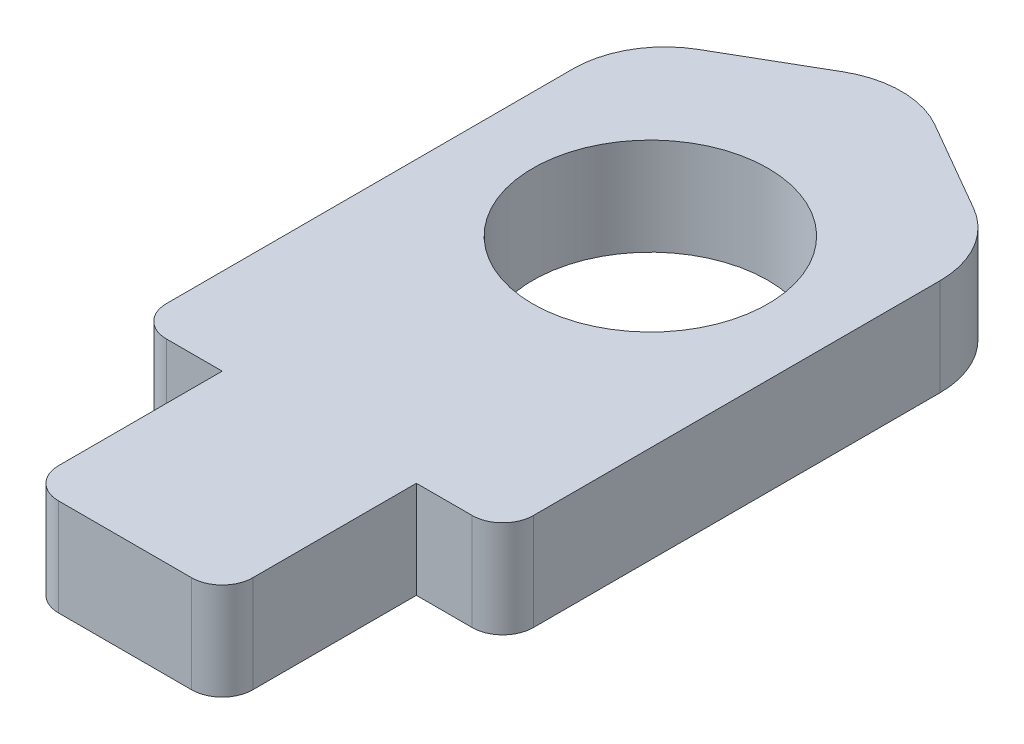
ISO-10303-21;
HEADER;
FILE_DESCRIPTION(('STEP AP214'),'2;1');
FILE_NAME('part.step','',(''),(''),'','','');
FILE_SCHEMA(('AUTOMOTIVE_DESIGN { 1 0 10303 214 1 1 1 1 }'));
ENDSEC;
DATA;
#1=APPLICATION_CONTEXT('core data for automotive mechanical design processes');
#2=APPLICATION_PROTOCOL_DEFINITION('international standard','automotive_design',2000,#1);
#3=PRODUCT_CONTEXT('',#1,'mechanical');
#4=PRODUCT('Part','Part','',(#3));
#5=PRODUCT_RELATED_PRODUCT_CATEGORY('part','',(#4));
#6=PRODUCT_DEFINITION_FORMATION('','',#4);
#7=PRODUCT_DEFINITION_CONTEXT('part definition',#1,'design');
#8=PRODUCT_DEFINITION('design','',#6,#7);
#9=PRODUCT_DEFINITION_SHAPE('','',#8);
#10=(LENGTH_UNIT() NAMED_UNIT(*) SI_UNIT(.MILLI.,.METRE.));
#11=(NAMED_UNIT(*) PLANE_ANGLE_UNIT() SI_UNIT($,.RADIAN.));
#12=(NAMED_UNIT(*) SI_UNIT($,.STERADIAN.) SOLID_ANGLE_UNIT());
#13=UNCERTAINTY_MEASURE_WITH_UNIT(LENGTH_MEASURE(1.E-05),#10,'distance_accuracy_value','');
#14=(GEOMETRIC_REPRESENTATION_CONTEXT(3) GLOBAL_UNCERTAINTY_ASSIGNED_CONTEXT((#13)) GLOBAL_UNIT_ASSIGNED_CONTEXT((#10,
#11,#12)) REPRESENTATION_CONTEXT('',''));
#15=CARTESIAN_POINT('',(0.,0.,0.));
#16=DIRECTION('',(0.,0.,1.));
#17=DIRECTION('',(1.,0.,0.));
#18=AXIS2_PLACEMENT_3D('',#15,#16,#17);
#19=CARTESIAN_POINT('',(3.75383111334908,3.175,-6.5018262113533));
#20=DIRECTION('',(0.500000000000009,0.,-0.866025403784434));
#21=DIRECTION('',(-0.866025403784434,0.,-0.500000000000009));
#22=AXIS2_PLACEMENT_3D('',#19,#20,#21);
#23=PLANE('',#22);
#24=DIRECTION('',(0.866025403784434,0.,0.500000000000009));
#25=VECTOR('',#24,1.);
#26=CARTESIAN_POINT('',(3.75383111334908,0.,-6.5018262113533));
#27=LINE('',#26,#25);
#28=CARTESIAN_POINT('',(1.50000000000001,0.,-7.80307621135336));
#29=VERTEX_POINT('',#28);
#30=CARTESIAN_POINT('',(4.50000000000001,0.,-6.07102540378445));
#31=VERTEX_POINT('',#30);
#32=EDGE_CURVE('E157',#29,#31,#27,.T.);
#33=ORIENTED_EDGE('',*,*,#32,.F.);
#34=DIRECTION('',(0.,-1.,0.));
#35=VECTOR('',#34,1.);
#36=CARTESIAN_POINT('',(1.50000000000001,3.175,-7.80307621135336));
#37=LINE('',#36,#35);
#38=CARTESIAN_POINT('',(1.50000000000001,3.175,-7.80307621135336));
#39=VERTEX_POINT('',#38);
#40=EDGE_CURVE('E151',#39,#29,#37,.T.);
#41=ORIENTED_EDGE('',*,*,#40,.F.);
#42=DIRECTION('',(0.866025403784434,0.,0.500000000000009));
#43=VECTOR('',#42,1.);
#44=CARTESIAN_POINT('',(3.75383111334908,3.175,-6.5018262113533));
#45=LINE('',#44,#43);
#46=CARTESIAN_POINT('',(4.50000000000001,3.175,-6.07102540378445));
#47=VERTEX_POINT('',#46);
#48=EDGE_CURVE('E154',#39,#47,#45,.T.);
#49=ORIENTED_EDGE('',*,*,#48,.T.);
#50=DIRECTION('',(0.,-1.,0.));
#51=VECTOR('',#50,1.);
#52=CARTESIAN_POINT('',(4.50000000000001,3.175,-6.07102540378445));
#53=LINE('',#52,#51);
#54=EDGE_CURVE('E204',#47,#31,#53,.T.);
#55=ORIENTED_EDGE('',*,*,#54,.T.);
#56=EDGE_LOOP('',(#33,#41,#49,#55));
#57=FACE_BOUND('',#56,.T.);
#58=ADVANCED_FACE('F36',(#57),#23,.T.);
#59=CARTESIAN_POINT('',(0.,3.175,-5.20499999999995));
#60=DIRECTION('',(0.,-1.,0.));
#61=DIRECTION('',(0.,0.,-1.));
#62=AXIS2_PLACEMENT_3D('',#59,#60,#61);
#63=CYLINDRICAL_SURFACE('',#62,3.00000000000009);
#64=CARTESIAN_POINT('',(0.,0.,-5.20499999999995));
#65=DIRECTION('',(0.,1.,0.));
#66=DIRECTION('',(0.,0.,1.));
#67=AXIS2_PLACEMENT_3D('',#64,#65,#66);
#68=CIRCLE('',#67,3.00000000000009);
#69=CARTESIAN_POINT('',(-1.50000000000001,0.,-7.80307621135336));
#70=VERTEX_POINT('',#69);
#71=EDGE_CURVE('E209',#29,#70,#68,.T.);
#72=ORIENTED_EDGE('',*,*,#71,.T.);
#73=DIRECTION('',(0.,-1.,0.));
#74=VECTOR('',#73,1.);
#75=CARTESIAN_POINT('',(-1.50000000000001,3.175,-7.80307621135336));
#76=LINE('',#75,#74);
#77=CARTESIAN_POINT('',(-1.50000000000001,3.175,-7.80307621135336));
#78=VERTEX_POINT('',#77);
#79=EDGE_CURVE('E162',#78,#70,#76,.T.);
#80=ORIENTED_EDGE('',*,*,#79,.F.);
#81=CARTESIAN_POINT('',(0.,3.175,-5.20499999999995));
#82=DIRECTION('',(0.,1.,0.));
#83=DIRECTION('',(0.,0.,1.));
#84=AXIS2_PLACEMENT_3D('',#81,#82,#83);
#85=CIRCLE('',#84,3.00000000000009);
#86=EDGE_CURVE('E165',#39,#78,#85,.T.);
#87=ORIENTED_EDGE('',*,*,#86,.F.);
#88=ORIENTED_EDGE('',*,*,#40,.T.);
#89=EDGE_LOOP('',(#72,#80,#87,#88));
#90=FACE_BOUND('',#89,.T.);
#91=ADVANCED_FACE('F166',(#90),#63,.T.);
#92=CARTESIAN_POINT('',(-3.75383111334908,3.175,-6.50182621135329));
#93=DIRECTION('',(-0.500000000000009,0.,-0.866025403784433));
#94=DIRECTION('',(-0.866025403784433,0.,0.500000000000009));
#95=AXIS2_PLACEMENT_3D('',#92,#93,#94);
#96=PLANE('',#95);
#97=DIRECTION('',(0.866025403784434,0.,-0.500000000000009));
#98=VECTOR('',#97,1.);
#99=CARTESIAN_POINT('',(-3.75383111334908,0.,-6.50182621135329));
#100=LINE('',#99,#98);
#101=CARTESIAN_POINT('',(-4.50000000000001,0.,-6.07102540378444));
#102=VERTEX_POINT('',#101);
#103=EDGE_CURVE('E211',#102,#70,#100,.T.);
#104=ORIENTED_EDGE('',*,*,#103,.F.);
#105=DIRECTION('',(0.,-1.,0.));
#106=VECTOR('',#105,1.);
#107=CARTESIAN_POINT('',(-4.50000000000001,3.175,-6.07102540378444));
#108=LINE('',#107,#106);
#109=CARTESIAN_POINT('',(-4.50000000000001,3.175,-6.07102540378444));
#110=VERTEX_POINT('',#109);
#111=EDGE_CURVE('E249',#110,#102,#108,.T.);
#112=ORIENTED_EDGE('',*,*,#111,.F.);
#113=DIRECTION('',(0.866025403784434,0.,-0.500000000000009));
#114=VECTOR('',#113,1.);
#115=CARTESIAN_POINT('',(-3.75383111334908,3.175,-6.50182621135329));
#116=LINE('',#115,#114);
#117=EDGE_CURVE('E169',#110,#78,#116,.T.);
#118=ORIENTED_EDGE('',*,*,#117,.T.);
#119=ORIENTED_EDGE('',*,*,#79,.T.);
#120=EDGE_LOOP('',(#104,#112,#118,#119));
#121=FACE_BOUND('',#120,.T.);
#122=ADVANCED_FACE('F318',(#121),#96,.T.);
#123=CARTESIAN_POINT('',(-3.,3.175,-3.47294919243113));
#124=DIRECTION('',(0.,-1.,0.));
#125=DIRECTION('',(0.,0.,-1.));
#126=AXIS2_PLACEMENT_3D('',#123,#124,#125);
#127=CYLINDRICAL_SURFACE('',#126,3.);
#128=CARTESIAN_POINT('',(-3.,0.,-3.47294919243113));
#129=DIRECTION('',(0.,1.,0.));
#130=DIRECTION('',(0.,0.,1.));
#131=AXIS2_PLACEMENT_3D('',#128,#129,#130);
#132=CIRCLE('',#131,3.);
#133=CARTESIAN_POINT('',(-6.,0.,-3.47294919243113));
#134=VERTEX_POINT('',#133);
#135=EDGE_CURVE('E214',#102,#134,#132,.T.);
#136=ORIENTED_EDGE('',*,*,#135,.T.);
#137=DIRECTION('',(0.,-1.,0.));
#138=VECTOR('',#137,1.);
#139=CARTESIAN_POINT('',(-6.,3.175,-3.47294919243113));
#140=LINE('',#139,#138);
#141=CARTESIAN_POINT('',(-6.,3.175,-3.47294919243113));
#142=VERTEX_POINT('',#141);
#143=EDGE_CURVE('E246',#142,#134,#140,.T.);
#144=ORIENTED_EDGE('',*,*,#143,.F.);
#145=CARTESIAN_POINT('',(-3.,3.175,-3.47294919243113));
#146=DIRECTION('',(0.,1.,0.));
#147=DIRECTION('',(0.,0.,1.));
#148=AXIS2_PLACEMENT_3D('',#145,#146,#147);
#149=CIRCLE('',#148,3.);
#150=EDGE_CURVE('E183',#110,#142,#149,.T.);
#151=ORIENTED_EDGE('',*,*,#150,.F.);
#152=ORIENTED_EDGE('',*,*,#111,.T.);
#153=EDGE_LOOP('',(#136,#144,#151,#152));
#154=FACE_BOUND('',#153,.T.);
#155=ADVANCED_FACE('F323',(#154),#127,.T.);
#156=CARTESIAN_POINT('',(-6.,3.175,0.));
#157=DIRECTION('',(1.,0.,0.));
#158=DIRECTION('',(0.,0.,-1.));
#159=AXIS2_PLACEMENT_3D('',#156,#157,#158);
#160=PLANE('',#159);
#161=DIRECTION('',(0.,0.,1.));
#162=VECTOR('',#161,1.);
#163=CARTESIAN_POINT('',(-6.,0.,0.));
#164=LINE('',#163,#162);
#165=CARTESIAN_POINT('',(-6.,0.,9.8257274));
#166=VERTEX_POINT('',#165);
#167=EDGE_CURVE('E217',#134,#166,#164,.T.);
#168=ORIENTED_EDGE('',*,*,#167,.T.);
#169=DIRECTION('',(0.,-1.,0.));
#170=VECTOR('',#169,1.);
#171=CARTESIAN_POINT('',(-6.,3.175,9.8257274));
#172=LINE('',#171,#170);
#173=CARTESIAN_POINT('',(-6.,3.175,9.8257274));
#174=VERTEX_POINT('',#173);
#175=EDGE_CURVE('E274',#166,#174,#172,.F.);
#176=ORIENTED_EDGE('',*,*,#175,.T.);
#177=DIRECTION('',(0.,0.,1.));
#178=VECTOR('',#177,1.);
#179=CARTESIAN_POINT('',(-6.,3.175,0.));
#180=LINE('',#179,#178);
#181=EDGE_CURVE('E186',#142,#174,#180,.T.);
#182=ORIENTED_EDGE('',*,*,#181,.F.);
#183=ORIENTED_EDGE('',*,*,#143,.T.);
#184=EDGE_LOOP('',(#168,#176,#182,#183));
#185=FACE_BOUND('',#184,.T.);
#186=ADVANCED_FACE('F325',(#185),#160,.F.);
#187=CARTESIAN_POINT('',(0.,3.175,10.8257274));
#188=DIRECTION('',(0.,0.,-1.));
#189=DIRECTION('',(-1.,0.,0.));
#190=AXIS2_PLACEMENT_3D('',#187,#188,#189);
#191=PLANE('',#190);
#192=DIRECTION('',(1.,0.,0.));
#193=VECTOR('',#192,1.);
#194=CARTESIAN_POINT('',(0.,3.175,10.8257274));
#195=LINE('',#194,#193);
#196=CARTESIAN_POINT('',(-5.,3.175,10.8257274));
#197=VERTEX_POINT('',#196);
#198=CARTESIAN_POINT('',(-3.175,3.175,10.8257274));
#199=VERTEX_POINT('',#198);
#200=EDGE_CURVE('E189',#197,#199,#195,.T.);
#201=ORIENTED_EDGE('',*,*,#200,.F.);
#202=DIRECTION('',(0.,-1.,0.));
#203=VECTOR('',#202,1.);
#204=CARTESIAN_POINT('',(-5.,3.175,10.8257274));
#205=LINE('',#204,#203);
#206=CARTESIAN_POINT('',(-5.,0.,10.8257274));
#207=VERTEX_POINT('',#206);
#208=EDGE_CURVE('E271',#197,#207,#205,.T.);
#209=ORIENTED_EDGE('',*,*,#208,.T.);
#210=DIRECTION('',(1.,0.,0.));
#211=VECTOR('',#210,1.);
#212=CARTESIAN_POINT('',(0.,0.,10.8257274));
#213=LINE('',#212,#211);
#214=CARTESIAN_POINT('',(-3.175,0.,10.8257274));
#215=VERTEX_POINT('',#214);
#216=EDGE_CURVE('E220',#207,#215,#213,.T.);
#217=ORIENTED_EDGE('',*,*,#216,.T.);
#218=DIRECTION('',(0.,-1.,0.));
#219=VECTOR('',#218,1.);
#220=CARTESIAN_POINT('',(-3.175,3.175,10.8257274));
#221=LINE('',#220,#219);
#222=EDGE_CURVE('E243',#199,#215,#221,.T.);
#223=ORIENTED_EDGE('',*,*,#222,.F.);
#224=EDGE_LOOP('',(#201,#209,#217,#223));
#225=FACE_BOUND('',#224,.T.);
#226=ADVANCED_FACE('F331',(#225),#191,.F.);
#227=CARTESIAN_POINT('',(-3.175,3.175,0.));
#228=DIRECTION('',(1.,0.,0.));
#229=DIRECTION('',(0.,0.,-1.));
#230=AXIS2_PLACEMENT_3D('',#227,#228,#229);
#231=PLANE('',#230);
#232=DIRECTION('',(0.,0.,1.));
#233=VECTOR('',#232,1.);
#234=CARTESIAN_POINT('',(-3.175,0.,0.));
#235=LINE('',#234,#233);
#236=CARTESIAN_POINT('',(-3.175,0.,16.1757274));
#237=VERTEX_POINT('',#236);
#238=EDGE_CURVE('E222',#215,#237,#235,.T.);
#239=ORIENTED_EDGE('',*,*,#238,.T.);
#240=DIRECTION('',(0.,-1.,0.));
#241=VECTOR('',#240,1.);
#242=CARTESIAN_POINT('',(-3.175,3.175,16.1757274));
#243=LINE('',#242,#241);
#244=CARTESIAN_POINT('',(-3.175,3.175,16.1757274));
#245=VERTEX_POINT('',#244);
#246=EDGE_CURVE('E44',#237,#245,#243,.F.);
#247=ORIENTED_EDGE('',*,*,#246,.T.);
#248=DIRECTION('',(0.,0.,1.));
#249=VECTOR('',#248,1.);
#250=CARTESIAN_POINT('',(-3.175,3.175,0.));
#251=LINE('',#250,#249);
#252=EDGE_CURVE('E191',#199,#245,#251,.T.);
#253=ORIENTED_EDGE('',*,*,#252,.F.);
#254=ORIENTED_EDGE('',*,*,#222,.T.);
#255=EDGE_LOOP('',(#239,#247,#253,#254));
#256=FACE_BOUND('',#255,.T.);
#257=ADVANCED_FACE('F282',(#256),#231,.F.);
#258=CARTESIAN_POINT('',(0.,3.175,17.1757274));
#259=DIRECTION('',(0.,0.,-1.));
#260=DIRECTION('',(-1.,0.,0.));
#261=AXIS2_PLACEMENT_3D('',#258,#259,#260);
#262=PLANE('',#261);
#263=DIRECTION('',(1.,0.,0.));
#264=VECTOR('',#263,1.);
#265=CARTESIAN_POINT('',(0.,3.175,17.1757274));
#266=LINE('',#265,#264);
#267=CARTESIAN_POINT('',(-2.175,3.175,17.1757274));
#268=VERTEX_POINT('',#267);
#269=CARTESIAN_POINT('',(2.175,3.175,17.1757274));
#270=VERTEX_POINT('',#269);
#271=EDGE_CURVE('E194',#268,#270,#266,.T.);
#272=ORIENTED_EDGE('',*,*,#271,.F.);
#273=DIRECTION('',(0.,-1.,0.));
#274=VECTOR('',#273,1.);
#275=CARTESIAN_POINT('',(-2.175,3.175,17.1757274));
#276=LINE('',#275,#274);
#277=CARTESIAN_POINT('',(-2.175,0.,17.1757274));
#278=VERTEX_POINT('',#277);
#279=EDGE_CURVE('E277',#268,#278,#276,.T.);
#280=ORIENTED_EDGE('',*,*,#279,.T.);
#281=DIRECTION('',(1.,0.,0.));
#282=VECTOR('',#281,1.);
#283=CARTESIAN_POINT('',(0.,0.,17.1757274));
#284=LINE('',#283,#282);
#285=CARTESIAN_POINT('',(2.175,0.,17.1757274));
#286=VERTEX_POINT('',#285);
#287=EDGE_CURVE('E225',#278,#286,#284,.T.);
#288=ORIENTED_EDGE('',*,*,#287,.T.);
#289=DIRECTION('',(0.,-1.,0.));
#290=VECTOR('',#289,1.);
#291=CARTESIAN_POINT('',(2.175,3.175,17.1757274));
#292=LINE('',#291,#290);
#293=EDGE_CURVE('E59',#286,#270,#292,.F.);
#294=ORIENTED_EDGE('',*,*,#293,.T.);
#295=EDGE_LOOP('',(#272,#280,#288,#294));
#296=FACE_BOUND('',#295,.T.);
#297=ADVANCED_FACE('F291',(#296),#262,.F.);
#298=CARTESIAN_POINT('',(3.17500000000001,3.175,0.));
#299=DIRECTION('',(-1.,0.,0.));
#300=DIRECTION('',(0.,0.,1.));
#301=AXIS2_PLACEMENT_3D('',#298,#299,#300);
#302=PLANE('',#301);
#303=DIRECTION('',(0.,0.,-1.));
#304=VECTOR('',#303,1.);
#305=CARTESIAN_POINT('',(3.17500000000001,3.175,0.));
#306=LINE('',#305,#304);
#307=CARTESIAN_POINT('',(3.175,3.175,16.1757274));
#308=VERTEX_POINT('',#307);
#309=CARTESIAN_POINT('',(3.175,3.175,10.8257274));
#310=VERTEX_POINT('',#309);
#311=EDGE_CURVE('E196',#308,#310,#306,.T.);
#312=ORIENTED_EDGE('',*,*,#311,.F.);
#313=DIRECTION('',(0.,-1.,0.));
#314=VECTOR('',#313,1.);
#315=CARTESIAN_POINT('',(3.175,3.175,16.1757274));
#316=LINE('',#315,#314);
#317=CARTESIAN_POINT('',(3.175,0.,16.1757274));
#318=VERTEX_POINT('',#317);
#319=EDGE_CURVE('E11',#308,#318,#316,.T.);
#320=ORIENTED_EDGE('',*,*,#319,.T.);
#321=DIRECTION('',(0.,0.,-1.));
#322=VECTOR('',#321,1.);
#323=CARTESIAN_POINT('',(3.17500000000001,0.,0.));
#324=LINE('',#323,#322);
#325=CARTESIAN_POINT('',(3.175,0.,10.8257274));
#326=VERTEX_POINT('',#325);
#327=EDGE_CURVE('E227',#318,#326,#324,.T.);
#328=ORIENTED_EDGE('',*,*,#327,.T.);
#329=DIRECTION('',(0.,-1.,0.));
#330=VECTOR('',#329,1.);
#331=CARTESIAN_POINT('',(3.175,3.175,10.8257274));
#332=LINE('',#331,#330);
#333=EDGE_CURVE('E240',#310,#326,#332,.T.);
#334=ORIENTED_EDGE('',*,*,#333,.F.);
#335=EDGE_LOOP('',(#312,#320,#328,#334));
#336=FACE_BOUND('',#335,.T.);
#337=ADVANCED_FACE('F299',(#336),#302,.F.);
#338=CARTESIAN_POINT('',(0.,3.175,10.8257274));
#339=DIRECTION('',(0.,0.,-1.));
#340=DIRECTION('',(-1.,0.,0.));
#341=AXIS2_PLACEMENT_3D('',#338,#339,#340);
#342=PLANE('',#341);
#343=DIRECTION('',(1.,0.,0.));
#344=VECTOR('',#343,1.);
#345=CARTESIAN_POINT('',(0.,0.,10.8257274));
#346=LINE('',#345,#344);
#347=CARTESIAN_POINT('',(5.,0.,10.8257274));
#348=VERTEX_POINT('',#347);
#349=EDGE_CURVE('E229',#326,#348,#346,.T.);
#350=ORIENTED_EDGE('',*,*,#349,.T.);
#351=DIRECTION('',(0.,-1.,0.));
#352=VECTOR('',#351,1.);
#353=CARTESIAN_POINT('',(5.,3.175,10.8257274));
#354=LINE('',#353,#352);
#355=CARTESIAN_POINT('',(5.,3.175,10.8257274));
#356=VERTEX_POINT('',#355);
#357=EDGE_CURVE('E262',#348,#356,#354,.F.);
#358=ORIENTED_EDGE('',*,*,#357,.T.);
#359=DIRECTION('',(1.,0.,0.));
#360=VECTOR('',#359,1.);
#361=CARTESIAN_POINT('',(0.,3.175,10.8257274));
#362=LINE('',#361,#360);
#363=EDGE_CURVE('E198',#310,#356,#362,.T.);
#364=ORIENTED_EDGE('',*,*,#363,.F.);
#365=ORIENTED_EDGE('',*,*,#333,.T.);
#366=EDGE_LOOP('',(#350,#358,#364,#365));
#367=FACE_BOUND('',#366,.T.);
#368=ADVANCED_FACE('F304',(#367),#342,.F.);
#369=CARTESIAN_POINT('',(6.,3.175,0.));
#370=DIRECTION('',(1.,0.,0.));
#371=DIRECTION('',(0.,0.,-1.));
#372=AXIS2_PLACEMENT_3D('',#369,#370,#371);
#373=PLANE('',#372);
#374=DIRECTION('',(0.,0.,1.));
#375=VECTOR('',#374,1.);
#376=CARTESIAN_POINT('',(6.,3.175,0.));
#377=LINE('',#376,#375);
#378=CARTESIAN_POINT('',(6.,3.175,-3.47294919243113));
#379=VERTEX_POINT('',#378);
#380=CARTESIAN_POINT('',(6.,3.175,9.8257274));
#381=VERTEX_POINT('',#380);
#382=EDGE_CURVE('E200',#379,#381,#377,.T.);
#383=ORIENTED_EDGE('',*,*,#382,.T.);
#384=DIRECTION('',(0.,-1.,0.));
#385=VECTOR('',#384,1.);
#386=CARTESIAN_POINT('',(6.,0.,9.8257274));
#387=LINE('',#386,#385);
#388=CARTESIAN_POINT('',(6.,0.,9.8257274));
#389=VERTEX_POINT('',#388);
#390=EDGE_CURVE('E161',#381,#389,#387,.T.);
#391=ORIENTED_EDGE('',*,*,#390,.T.);
#392=DIRECTION('',(0.,0.,1.));
#393=VECTOR('',#392,1.);
#394=CARTESIAN_POINT('',(6.,0.,0.));
#395=LINE('',#394,#393);
#396=CARTESIAN_POINT('',(6.,0.,-3.47294919243113));
#397=VERTEX_POINT('',#396);
#398=EDGE_CURVE('E232',#397,#389,#395,.T.);
#399=ORIENTED_EDGE('',*,*,#398,.F.);
#400=DIRECTION('',(0.,-1.,0.));
#401=VECTOR('',#400,1.);
#402=CARTESIAN_POINT('',(6.,3.175,-3.47294919243113));
#403=LINE('',#402,#401);
#404=EDGE_CURVE('E238',#379,#397,#403,.T.);
#405=ORIENTED_EDGE('',*,*,#404,.F.);
#406=EDGE_LOOP('',(#383,#391,#399,#405));
#407=FACE_BOUND('',#406,.T.);
#408=ADVANCED_FACE('F310',(#407),#373,.T.);
#409=CARTESIAN_POINT('',(0.,3.175,0.));
#410=DIRECTION('',(0.,-1.,0.));
#411=DIRECTION('',(0.,0.,-1.));
#412=AXIS2_PLACEMENT_3D('',#409,#410,#411);
#413=CYLINDRICAL_SURFACE('',#412,3.845);
#414=CARTESIAN_POINT('',(0.,3.175,0.));
#415=DIRECTION('',(0.,1.,0.));
#416=DIRECTION('',(0.,0.,1.));
#417=AXIS2_PLACEMENT_3D('',#414,#415,#416);
#418=CIRCLE('',#417,3.845);
#419=CARTESIAN_POINT('',(0.,3.175,3.845));
#420=VERTEX_POINT('',#419);
#421=EDGE_CURVE('E176',#420,#420,#418,.T.);
#422=ORIENTED_EDGE('',*,*,#421,.T.);
#423=EDGE_LOOP('',(#422));
#424=FACE_BOUND('',#423,.T.);
#425=CARTESIAN_POINT('',(0.,0.,0.));
#426=DIRECTION('',(0.,1.,0.));
#427=DIRECTION('',(0.,0.,1.));
#428=AXIS2_PLACEMENT_3D('',#425,#426,#427);
#429=CIRCLE('',#428,3.845);
#430=CARTESIAN_POINT('',(0.,0.,3.845));
#431=VERTEX_POINT('',#430);
#432=EDGE_CURVE('E205',#431,#431,#429,.T.);
#433=ORIENTED_EDGE('',*,*,#432,.F.);
#434=EDGE_LOOP('',(#433));
#435=FACE_BOUND('',#434,.T.);
#436=ADVANCED_FACE('F349',(#424,#435),#413,.F.);
#437=CARTESIAN_POINT('',(3.,3.175,-3.47294919243113));
#438=DIRECTION('',(0.,-1.,0.));
#439=DIRECTION('',(0.,0.,-1.));
#440=AXIS2_PLACEMENT_3D('',#437,#438,#439);
#441=CYLINDRICAL_SURFACE('',#440,3.);
#442=CARTESIAN_POINT('',(3.,0.,-3.47294919243113));
#443=DIRECTION('',(0.,1.,0.));
#444=DIRECTION('',(0.,0.,1.));
#445=AXIS2_PLACEMENT_3D('',#442,#443,#444);
#446=CIRCLE('',#445,3.);
#447=EDGE_CURVE('E179',#31,#397,#446,.F.);
#448=ORIENTED_EDGE('',*,*,#447,.F.);
#449=ORIENTED_EDGE('',*,*,#54,.F.);
#450=CARTESIAN_POINT('',(3.,3.175,-3.47294919243113));
#451=DIRECTION('',(0.,1.,0.));
#452=DIRECTION('',(0.,0.,1.));
#453=AXIS2_PLACEMENT_3D('',#450,#451,#452);
#454=CIRCLE('',#453,3.);
#455=EDGE_CURVE('E175',#47,#379,#454,.F.);
#456=ORIENTED_EDGE('',*,*,#455,.T.);
#457=ORIENTED_EDGE('',*,*,#404,.T.);
#458=EDGE_LOOP('',(#448,#449,#456,#457));
#459=FACE_BOUND('',#458,.T.);
#460=ADVANCED_FACE('F314',(#459),#441,.T.);
#461=CARTESIAN_POINT('',(0.,3.175,0.));
#462=DIRECTION('',(0.,1.,0.));
#463=DIRECTION('',(0.,0.,1.));
#464=AXIS2_PLACEMENT_3D('',#461,#462,#463);
#465=PLANE('',#464);
#466=ORIENTED_EDGE('',*,*,#421,.F.);
#467=EDGE_LOOP('',(#466));
#468=FACE_BOUND('',#467,.T.);
#469=ORIENTED_EDGE('',*,*,#363,.T.);
#470=CARTESIAN_POINT('',(5.,3.175,9.8257274));
#471=DIRECTION('',(0.,1.,0.));
#472=DIRECTION('',(0.,0.,1.));
#473=AXIS2_PLACEMENT_3D('',#470,#471,#472);
#474=CIRCLE('',#473,1.);
#475=EDGE_CURVE('E269',#356,#381,#474,.T.);
#476=ORIENTED_EDGE('',*,*,#475,.T.);
#477=ORIENTED_EDGE('',*,*,#382,.F.);
#478=ORIENTED_EDGE('',*,*,#455,.F.);
#479=ORIENTED_EDGE('',*,*,#48,.F.);
#480=ORIENTED_EDGE('',*,*,#86,.T.);
#481=ORIENTED_EDGE('',*,*,#117,.F.);
#482=ORIENTED_EDGE('',*,*,#150,.T.);
#483=ORIENTED_EDGE('',*,*,#181,.T.);
#484=CARTESIAN_POINT('',(-5.,3.175,9.8257274));
#485=DIRECTION('',(0.,1.,0.));
#486=DIRECTION('',(0.,0.,1.));
#487=AXIS2_PLACEMENT_3D('',#484,#485,#486);
#488=CIRCLE('',#487,1.);
#489=EDGE_CURVE('E267',#174,#197,#488,.T.);
#490=ORIENTED_EDGE('',*,*,#489,.T.);
#491=ORIENTED_EDGE('',*,*,#200,.T.);
#492=ORIENTED_EDGE('',*,*,#252,.T.);
#493=CARTESIAN_POINT('',(-2.175,3.175,16.1757274));
#494=DIRECTION('',(0.,1.,0.));
#495=DIRECTION('',(0.,0.,1.));
#496=AXIS2_PLACEMENT_3D('',#493,#494,#495);
#497=CIRCLE('',#496,1.);
#498=EDGE_CURVE('E265',#245,#268,#497,.T.);
#499=ORIENTED_EDGE('',*,*,#498,.T.);
#500=ORIENTED_EDGE('',*,*,#271,.T.);
#501=CARTESIAN_POINT('',(2.175,3.175,16.1757274));
#502=DIRECTION('',(0.,1.,0.));
#503=DIRECTION('',(0.,0.,1.));
#504=AXIS2_PLACEMENT_3D('',#501,#502,#503);
#505=CIRCLE('',#504,1.);
#506=EDGE_CURVE('E51',#270,#308,#505,.T.);
#507=ORIENTED_EDGE('',*,*,#506,.T.);
#508=ORIENTED_EDGE('',*,*,#311,.T.);
#509=EDGE_LOOP('',(#469,#476,#477,#478,#479,#480,#481,#482,#483,#490,#491,#492,#499,#500,#507,#508));
#510=FACE_BOUND('',#509,.T.);
#511=ADVANCED_FACE('F172',(#468,#510),#465,.T.);
#512=CARTESIAN_POINT('',(0.,0.,0.));
#513=DIRECTION('',(0.,1.,0.));
#514=DIRECTION('',(0.,0.,1.));
#515=AXIS2_PLACEMENT_3D('',#512,#513,#514);
#516=PLANE('',#515);
#517=ORIENTED_EDGE('',*,*,#432,.T.);
#518=EDGE_LOOP('',(#517));
#519=FACE_BOUND('',#518,.T.);
#520=ORIENTED_EDGE('',*,*,#398,.T.);
#521=CARTESIAN_POINT('',(5.,0.,9.8257274));
#522=DIRECTION('',(0.,1.,0.));
#523=DIRECTION('',(0.,0.,1.));
#524=AXIS2_PLACEMENT_3D('',#521,#522,#523);
#525=CIRCLE('',#524,1.);
#526=EDGE_CURVE('E260',#389,#348,#525,.F.);
#527=ORIENTED_EDGE('',*,*,#526,.T.);
#528=ORIENTED_EDGE('',*,*,#349,.F.);
#529=ORIENTED_EDGE('',*,*,#327,.F.);
#530=CARTESIAN_POINT('',(2.175,0.,16.1757274));
#531=DIRECTION('',(0.,1.,0.));
#532=DIRECTION('',(0.,0.,1.));
#533=AXIS2_PLACEMENT_3D('',#530,#531,#532);
#534=CIRCLE('',#533,1.);
#535=EDGE_CURVE('E254',#318,#286,#534,.F.);
#536=ORIENTED_EDGE('',*,*,#535,.T.);
#537=ORIENTED_EDGE('',*,*,#287,.F.);
#538=CARTESIAN_POINT('',(-2.175,0.,16.1757274));
#539=DIRECTION('',(0.,1.,0.));
#540=DIRECTION('',(0.,0.,1.));
#541=AXIS2_PLACEMENT_3D('',#538,#539,#540);
#542=CIRCLE('',#541,1.);
#543=EDGE_CURVE('E256',#278,#237,#542,.F.);
#544=ORIENTED_EDGE('',*,*,#543,.T.);
#545=ORIENTED_EDGE('',*,*,#238,.F.);
#546=ORIENTED_EDGE('',*,*,#216,.F.);
#547=CARTESIAN_POINT('',(-5.,0.,9.8257274));
#548=DIRECTION('',(0.,1.,0.));
#549=DIRECTION('',(0.,0.,1.));
#550=AXIS2_PLACEMENT_3D('',#547,#548,#549);
#551=CIRCLE('',#550,1.);
#552=EDGE_CURVE('E258',#207,#166,#551,.F.);
#553=ORIENTED_EDGE('',*,*,#552,.T.);
#554=ORIENTED_EDGE('',*,*,#167,.F.);
#555=ORIENTED_EDGE('',*,*,#135,.F.);
#556=ORIENTED_EDGE('',*,*,#103,.T.);
#557=ORIENTED_EDGE('',*,*,#71,.F.);
#558=ORIENTED_EDGE('',*,*,#32,.T.);
#559=ORIENTED_EDGE('',*,*,#447,.T.);
#560=EDGE_LOOP('',(#520,#527,#528,#529,#536,#537,#544,#545,#546,#553,#554,#555,#556,#557,#558,#559));
#561=FACE_BOUND('',#560,.T.);
#562=ADVANCED_FACE('F293',(#519,#561),#516,.F.);
#563=CARTESIAN_POINT('',(5.,3.175,9.8257274));
#564=DIRECTION('',(0.,1.,0.));
#565=DIRECTION('',(0.,0.,1.));
#566=AXIS2_PLACEMENT_3D('',#563,#564,#565);
#567=CYLINDRICAL_SURFACE('',#566,1.);
#568=ORIENTED_EDGE('',*,*,#475,.F.);
#569=ORIENTED_EDGE('',*,*,#357,.F.);
#570=ORIENTED_EDGE('',*,*,#526,.F.);
#571=ORIENTED_EDGE('',*,*,#390,.F.);
#572=EDGE_LOOP('',(#568,#569,#570,#571));
#573=FACE_BOUND('',#572,.T.);
#574=ADVANCED_FACE('F307',(#573),#567,.T.);
#575=CARTESIAN_POINT('',(-5.,3.175,9.8257274));
#576=DIRECTION('',(0.,-1.,0.));
#577=DIRECTION('',(0.,0.,-1.));
#578=AXIS2_PLACEMENT_3D('',#575,#576,#577);
#579=CYLINDRICAL_SURFACE('',#578,1.);
#580=ORIENTED_EDGE('',*,*,#489,.F.);
#581=ORIENTED_EDGE('',*,*,#175,.F.);
#582=ORIENTED_EDGE('',*,*,#552,.F.);
#583=ORIENTED_EDGE('',*,*,#208,.F.);
#584=EDGE_LOOP('',(#580,#581,#582,#583));
#585=FACE_BOUND('',#584,.T.);
#586=ADVANCED_FACE('F328',(#585),#579,.T.);
#587=CARTESIAN_POINT('',(-2.175,3.175,16.1757274));
#588=DIRECTION('',(0.,-1.,0.));
#589=DIRECTION('',(0.,0.,-1.));
#590=AXIS2_PLACEMENT_3D('',#587,#588,#589);
#591=CYLINDRICAL_SURFACE('',#590,1.);
#592=ORIENTED_EDGE('',*,*,#498,.F.);
#593=ORIENTED_EDGE('',*,*,#246,.F.);
#594=ORIENTED_EDGE('',*,*,#543,.F.);
#595=ORIENTED_EDGE('',*,*,#279,.F.);
#596=EDGE_LOOP('',(#592,#593,#594,#595));
#597=FACE_BOUND('',#596,.T.);
#598=ADVANCED_FACE('F289',(#597),#591,.T.);
#599=CARTESIAN_POINT('',(2.175,3.175,16.1757274));
#600=DIRECTION('',(0.,-1.,0.));
#601=DIRECTION('',(0.,0.,-1.));
#602=AXIS2_PLACEMENT_3D('',#599,#600,#601);
#603=CYLINDRICAL_SURFACE('',#602,1.);
#604=ORIENTED_EDGE('',*,*,#506,.F.);
#605=ORIENTED_EDGE('',*,*,#293,.F.);
#606=ORIENTED_EDGE('',*,*,#535,.F.);
#607=ORIENTED_EDGE('',*,*,#319,.F.);
#608=EDGE_LOOP('',(#604,#605,#606,#607));
#609=FACE_BOUND('',#608,.T.);
#610=ADVANCED_FACE('F38',(#609),#603,.T.);
#611=CLOSED_SHELL('',(#58,#91,#122,#155,#186,#226,#257,#297,#337,#368,#408,#436,#460,#511,#562,
#574,#586,#598,#610));
#612=MANIFOLD_SOLID_BREP('B2',#611);
#613=ADVANCED_BREP_SHAPE_REPRESENTATION('',(#18,#612),#14);
#614=SHAPE_DEFINITION_REPRESENTATION(#9,#613);
ENDSEC;
END-ISO-10303-21;
